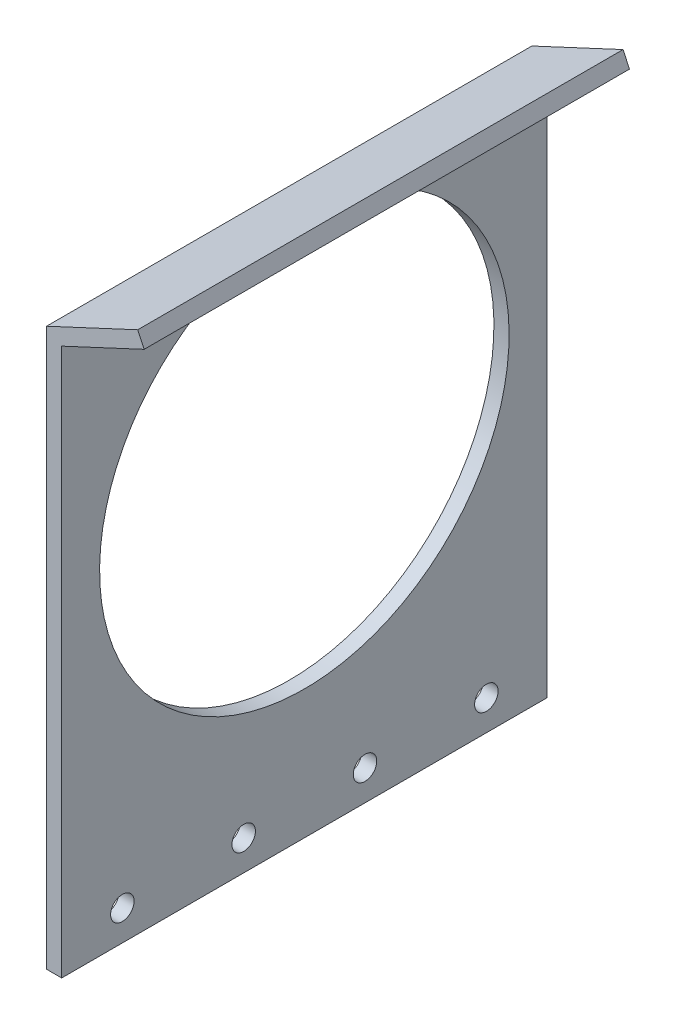
ISO-10303-21;
HEADER;
FILE_DESCRIPTION(('STEP AP214'),'2;1');
FILE_NAME('part.step','',(''),(''),'','','');
FILE_SCHEMA(('AUTOMOTIVE_DESIGN { 1 0 10303 214 1 1 1 1 }'));
ENDSEC;
DATA;
#1=APPLICATION_CONTEXT('core data for automotive mechanical design processes');
#2=APPLICATION_PROTOCOL_DEFINITION('international standard','automotive_design',2000,#1);
#3=PRODUCT_CONTEXT('',#1,'mechanical');
#4=PRODUCT('Part','Part','',(#3));
#5=PRODUCT_RELATED_PRODUCT_CATEGORY('part','',(#4));
#6=PRODUCT_DEFINITION_FORMATION('','',#4);
#7=PRODUCT_DEFINITION_CONTEXT('part definition',#1,'design');
#8=PRODUCT_DEFINITION('design','',#6,#7);
#9=PRODUCT_DEFINITION_SHAPE('','',#8);
#10=(LENGTH_UNIT() NAMED_UNIT(*) SI_UNIT(.MILLI.,.METRE.));
#11=(NAMED_UNIT(*) PLANE_ANGLE_UNIT() SI_UNIT($,.RADIAN.));
#12=(NAMED_UNIT(*) SI_UNIT($,.STERADIAN.) SOLID_ANGLE_UNIT());
#13=UNCERTAINTY_MEASURE_WITH_UNIT(LENGTH_MEASURE(1.E-05),#10,'distance_accuracy_value','');
#14=(GEOMETRIC_REPRESENTATION_CONTEXT(3) GLOBAL_UNCERTAINTY_ASSIGNED_CONTEXT((#13)) GLOBAL_UNIT_ASSIGNED_CONTEXT((#10,
#11,#12)) REPRESENTATION_CONTEXT('',''));
#15=CARTESIAN_POINT('',(0.,0.,0.));
#16=DIRECTION('',(0.,0.,1.));
#17=DIRECTION('',(1.,0.,0.));
#18=AXIS2_PLACEMENT_3D('',#15,#16,#17);
#19=CARTESIAN_POINT('',(3.175,0.,101.6));
#20=DIRECTION('',(0.,-1.,0.));
#21=DIRECTION('',(0.,0.,-1.));
#22=AXIS2_PLACEMENT_3D('',#19,#20,#21);
#23=PLANE('',#22);
#24=DIRECTION('',(-1.,0.,0.));
#25=VECTOR('',#24,1.);
#26=CARTESIAN_POINT('',(3.175,0.,0.));
#27=LINE('',#26,#25);
#28=CARTESIAN_POINT('',(3.175,0.,0.));
#29=VERTEX_POINT('',#28);
#30=CARTESIAN_POINT('',(0.,0.,0.));
#31=VERTEX_POINT('',#30);
#32=EDGE_CURVE('E118',#29,#31,#27,.T.);
#33=ORIENTED_EDGE('',*,*,#32,.F.);
#34=DIRECTION('',(0.,0.,-1.));
#35=VECTOR('',#34,1.);
#36=CARTESIAN_POINT('',(3.175,0.,101.6));
#37=LINE('',#36,#35);
#38=CARTESIAN_POINT('',(3.175,0.,101.6));
#39=VERTEX_POINT('',#38);
#40=EDGE_CURVE('E11',#39,#29,#37,.T.);
#41=ORIENTED_EDGE('',*,*,#40,.F.);
#42=DIRECTION('',(-1.,0.,0.));
#43=VECTOR('',#42,1.);
#44=CARTESIAN_POINT('',(3.175,0.,101.6));
#45=LINE('',#44,#43);
#46=CARTESIAN_POINT('',(0.,0.,101.6));
#47=VERTEX_POINT('',#46);
#48=EDGE_CURVE('E133',#39,#47,#45,.T.);
#49=ORIENTED_EDGE('',*,*,#48,.T.);
#50=DIRECTION('',(0.,0.,-1.));
#51=VECTOR('',#50,1.);
#52=CARTESIAN_POINT('',(0.,0.,101.6));
#53=LINE('',#52,#51);
#54=EDGE_CURVE('E82',#47,#31,#53,.T.);
#55=ORIENTED_EDGE('',*,*,#54,.T.);
#56=EDGE_LOOP('',(#33,#41,#49,#55));
#57=FACE_BOUND('',#56,.T.);
#58=ADVANCED_FACE('F32',(#57),#23,.T.);
#59=CARTESIAN_POINT('',(3.17499999999999,114.554,101.6));
#60=DIRECTION('',(1.,0.,0.));
#61=DIRECTION('',(0.,1.,0.));
#62=AXIS2_PLACEMENT_3D('',#59,#60,#61);
#63=PLANE('',#62);
#64=CARTESIAN_POINT('',(3.17499999999999,69.85,50.8));
#65=DIRECTION('',(1.,0.,0.));
#66=DIRECTION('',(0.,1.,0.));
#67=AXIS2_PLACEMENT_3D('',#64,#65,#66);
#68=CIRCLE('',#67,42.8625);
#69=CARTESIAN_POINT('',(3.17499999999999,112.7125,50.8));
#70=VERTEX_POINT('',#69);
#71=EDGE_CURVE('E202',#70,#70,#68,.T.);
#72=ORIENTED_EDGE('',*,*,#71,.F.);
#73=EDGE_LOOP('',(#72));
#74=FACE_BOUND('',#73,.T.);
#75=CARTESIAN_POINT('',(3.175,6.34999999999999,88.9));
#76=DIRECTION('',(1.,0.,0.));
#77=DIRECTION('',(0.,0.,-1.));
#78=AXIS2_PLACEMENT_3D('',#75,#76,#77);
#79=CIRCLE('',#78,2.45744999999999);
#80=CARTESIAN_POINT('',(3.175,6.34999999999999,86.44255));
#81=VERTEX_POINT('',#80);
#82=EDGE_CURVE('E199',#81,#81,#79,.T.);
#83=ORIENTED_EDGE('',*,*,#82,.F.);
#84=EDGE_LOOP('',(#83));
#85=FACE_BOUND('',#84,.T.);
#86=CARTESIAN_POINT('',(3.175,6.35,63.5));
#87=DIRECTION('',(1.,0.,0.));
#88=DIRECTION('',(0.,0.,-1.));
#89=AXIS2_PLACEMENT_3D('',#86,#87,#88);
#90=CIRCLE('',#89,2.45744999999999);
#91=CARTESIAN_POINT('',(3.175,6.35,61.04255));
#92=VERTEX_POINT('',#91);
#93=EDGE_CURVE('E195',#92,#92,#90,.T.);
#94=ORIENTED_EDGE('',*,*,#93,.F.);
#95=EDGE_LOOP('',(#94));
#96=FACE_BOUND('',#95,.T.);
#97=CARTESIAN_POINT('',(3.175,6.35,38.1));
#98=DIRECTION('',(1.,0.,0.));
#99=DIRECTION('',(0.,0.,-1.));
#100=AXIS2_PLACEMENT_3D('',#97,#98,#99);
#101=CIRCLE('',#100,2.45744999999999);
#102=CARTESIAN_POINT('',(3.175,6.35,35.64255));
#103=VERTEX_POINT('',#102);
#104=EDGE_CURVE('E191',#103,#103,#101,.T.);
#105=ORIENTED_EDGE('',*,*,#104,.F.);
#106=EDGE_LOOP('',(#105));
#107=FACE_BOUND('',#106,.T.);
#108=CARTESIAN_POINT('',(3.175,6.35,12.7));
#109=DIRECTION('',(1.,0.,0.));
#110=DIRECTION('',(0.,0.,-1.));
#111=AXIS2_PLACEMENT_3D('',#108,#109,#110);
#112=CIRCLE('',#111,2.45744999999999);
#113=CARTESIAN_POINT('',(3.175,6.35,10.24255));
#114=VERTEX_POINT('',#113);
#115=EDGE_CURVE('E184',#114,#114,#112,.T.);
#116=ORIENTED_EDGE('',*,*,#115,.F.);
#117=EDGE_LOOP('',(#116));
#118=FACE_BOUND('',#117,.T.);
#119=DIRECTION('',(0.,-1.,0.));
#120=VECTOR('',#119,1.);
#121=CARTESIAN_POINT('',(3.17499999999999,114.554,0.));
#122=LINE('',#121,#120);
#123=CARTESIAN_POINT('',(3.17499999999999,114.554,0.));
#124=VERTEX_POINT('',#123);
#125=EDGE_CURVE('E131',#124,#29,#122,.T.);
#126=ORIENTED_EDGE('',*,*,#125,.F.);
#127=DIRECTION('',(0.,0.,-1.));
#128=VECTOR('',#127,1.);
#129=CARTESIAN_POINT('',(3.17499999999999,114.554,101.6));
#130=LINE('',#129,#128);
#131=CARTESIAN_POINT('',(3.17499999999999,114.554,101.6));
#132=VERTEX_POINT('',#131);
#133=EDGE_CURVE('E41',#132,#124,#130,.T.);
#134=ORIENTED_EDGE('',*,*,#133,.F.);
#135=DIRECTION('',(0.,-1.,0.));
#136=VECTOR('',#135,1.);
#137=CARTESIAN_POINT('',(3.17499999999999,114.554,101.6));
#138=LINE('',#137,#136);
#139=EDGE_CURVE('E108',#132,#39,#138,.T.);
#140=ORIENTED_EDGE('',*,*,#139,.T.);
#141=ORIENTED_EDGE('',*,*,#40,.T.);
#142=EDGE_LOOP('',(#126,#134,#140,#141));
#143=FACE_BOUND('',#142,.T.);
#144=ADVANCED_FACE('F142',(#74,#85,#96,#107,#118,#143),#63,.T.);
#145=CARTESIAN_POINT('',(20.4401633430482,122.60487788616,101.6));
#146=DIRECTION('',(0.422618261740696,-0.906307787036651,0.));
#147=DIRECTION('',(0.906307787036651,0.422618261740697,0.));
#148=AXIS2_PLACEMENT_3D('',#145,#146,#147);
#149=PLANE('',#148);
#150=DIRECTION('',(-0.906307787036651,-0.422618261740697,0.));
#151=VECTOR('',#150,1.);
#152=CARTESIAN_POINT('',(20.4401633430482,122.60487788616,0.));
#153=LINE('',#152,#151);
#154=CARTESIAN_POINT('',(20.4401633430482,122.60487788616,0.));
#155=VERTEX_POINT('',#154);
#156=EDGE_CURVE('E95',#155,#124,#153,.T.);
#157=ORIENTED_EDGE('',*,*,#156,.F.);
#158=DIRECTION('',(0.,0.,-1.));
#159=VECTOR('',#158,1.);
#160=CARTESIAN_POINT('',(20.4401633430482,122.60487788616,101.6));
#161=LINE('',#160,#159);
#162=CARTESIAN_POINT('',(20.4401633430482,122.60487788616,101.6));
#163=VERTEX_POINT('',#162);
#164=EDGE_CURVE('E90',#163,#155,#161,.T.);
#165=ORIENTED_EDGE('',*,*,#164,.F.);
#166=DIRECTION('',(-0.906307787036651,-0.422618261740697,0.));
#167=VECTOR('',#166,1.);
#168=CARTESIAN_POINT('',(20.4401633430482,122.60487788616,101.6));
#169=LINE('',#168,#167);
#170=EDGE_CURVE('E93',#163,#132,#169,.T.);
#171=ORIENTED_EDGE('',*,*,#170,.T.);
#172=ORIENTED_EDGE('',*,*,#133,.T.);
#173=EDGE_LOOP('',(#157,#165,#171,#172));
#174=FACE_BOUND('',#173,.T.);
#175=ADVANCED_FACE('F92',(#174),#149,.T.);
#176=CARTESIAN_POINT('',(19.0983503620215,125.482405110002,101.6));
#177=DIRECTION('',(0.906307787036651,0.422618261740697,0.));
#178=DIRECTION('',(-0.422618261740697,0.906307787036651,0.));
#179=AXIS2_PLACEMENT_3D('',#176,#177,#178);
#180=PLANE('',#179);
#181=DIRECTION('',(0.422618261740697,-0.906307787036651,0.));
#182=VECTOR('',#181,1.);
#183=CARTESIAN_POINT('',(19.0983503620215,125.482405110002,0.));
#184=LINE('',#183,#182);
#185=CARTESIAN_POINT('',(19.0983503620215,125.482405110002,0.));
#186=VERTEX_POINT('',#185);
#187=EDGE_CURVE('E128',#186,#155,#184,.T.);
#188=ORIENTED_EDGE('',*,*,#187,.F.);
#189=DIRECTION('',(0.,0.,-1.));
#190=VECTOR('',#189,1.);
#191=CARTESIAN_POINT('',(19.0983503620215,125.482405110002,101.6));
#192=LINE('',#191,#190);
#193=CARTESIAN_POINT('',(19.0983503620215,125.482405110002,101.6));
#194=VERTEX_POINT('',#193);
#195=EDGE_CURVE('E100',#194,#186,#192,.T.);
#196=ORIENTED_EDGE('',*,*,#195,.F.);
#197=DIRECTION('',(0.422618261740697,-0.906307787036651,0.));
#198=VECTOR('',#197,1.);
#199=CARTESIAN_POINT('',(19.0983503620215,125.482405110002,101.6));
#200=LINE('',#199,#198);
#201=EDGE_CURVE('E106',#194,#163,#200,.T.);
#202=ORIENTED_EDGE('',*,*,#201,.T.);
#203=ORIENTED_EDGE('',*,*,#164,.T.);
#204=EDGE_LOOP('',(#188,#196,#202,#203));
#205=FACE_BOUND('',#204,.T.);
#206=ADVANCED_FACE('F110',(#205),#180,.T.);
#207=CARTESIAN_POINT('',(0.,116.576698078064,101.6));
#208=DIRECTION('',(-0.422618261740696,0.906307787036651,0.));
#209=DIRECTION('',(-0.906307787036651,-0.422618261740696,0.));
#210=AXIS2_PLACEMENT_3D('',#207,#208,#209);
#211=PLANE('',#210);
#212=DIRECTION('',(0.906307787036651,0.422618261740696,0.));
#213=VECTOR('',#212,1.);
#214=CARTESIAN_POINT('',(0.,116.576698078064,0.));
#215=LINE('',#214,#213);
#216=CARTESIAN_POINT('',(0.,116.576698078064,0.));
#217=VERTEX_POINT('',#216);
#218=EDGE_CURVE('E125',#217,#186,#215,.T.);
#219=ORIENTED_EDGE('',*,*,#218,.F.);
#220=DIRECTION('',(0.,0.,-1.));
#221=VECTOR('',#220,1.);
#222=CARTESIAN_POINT('',(0.,116.576698078064,101.6));
#223=LINE('',#222,#221);
#224=CARTESIAN_POINT('',(0.,116.576698078064,101.6));
#225=VERTEX_POINT('',#224);
#226=EDGE_CURVE('E137',#225,#217,#223,.T.);
#227=ORIENTED_EDGE('',*,*,#226,.F.);
#228=DIRECTION('',(0.906307787036651,0.422618261740696,0.));
#229=VECTOR('',#228,1.);
#230=CARTESIAN_POINT('',(0.,116.576698078064,101.6));
#231=LINE('',#230,#229);
#232=EDGE_CURVE('E111',#225,#194,#231,.T.);
#233=ORIENTED_EDGE('',*,*,#232,.T.);
#234=ORIENTED_EDGE('',*,*,#195,.T.);
#235=EDGE_LOOP('',(#219,#227,#233,#234));
#236=FACE_BOUND('',#235,.T.);
#237=ADVANCED_FACE('F158',(#236),#211,.T.);
#238=CARTESIAN_POINT('',(0.,0.,101.6));
#239=DIRECTION('',(-1.,0.,0.));
#240=DIRECTION('',(0.,0.,1.));
#241=AXIS2_PLACEMENT_3D('',#238,#239,#240);
#242=PLANE('',#241);
#243=CARTESIAN_POINT('',(0.,69.85,50.8));
#244=DIRECTION('',(-1.,0.,0.));
#245=DIRECTION('',(0.,0.,1.));
#246=AXIS2_PLACEMENT_3D('',#243,#244,#245);
#247=CIRCLE('',#246,42.8625);
#248=CARTESIAN_POINT('',(0.,69.85,93.6625));
#249=VERTEX_POINT('',#248);
#250=EDGE_CURVE('E35',#249,#249,#247,.T.);
#251=ORIENTED_EDGE('',*,*,#250,.F.);
#252=EDGE_LOOP('',(#251));
#253=FACE_BOUND('',#252,.T.);
#254=CARTESIAN_POINT('',(0.,6.34999999999999,88.9));
#255=DIRECTION('',(1.,0.,0.));
#256=DIRECTION('',(0.,0.,-1.));
#257=AXIS2_PLACEMENT_3D('',#254,#255,#256);
#258=CIRCLE('',#257,2.45745);
#259=CARTESIAN_POINT('',(0.,6.34999999999999,86.44255));
#260=VERTEX_POINT('',#259);
#261=EDGE_CURVE('E172',#260,#260,#258,.T.);
#262=ORIENTED_EDGE('',*,*,#261,.T.);
#263=EDGE_LOOP('',(#262));
#264=FACE_BOUND('',#263,.T.);
#265=CARTESIAN_POINT('',(0.,6.35,63.5));
#266=DIRECTION('',(1.,0.,0.));
#267=DIRECTION('',(0.,0.,-1.));
#268=AXIS2_PLACEMENT_3D('',#265,#266,#267);
#269=CIRCLE('',#268,2.45745);
#270=CARTESIAN_POINT('',(0.,6.35,61.04255));
#271=VERTEX_POINT('',#270);
#272=EDGE_CURVE('E176',#271,#271,#269,.T.);
#273=ORIENTED_EDGE('',*,*,#272,.T.);
#274=EDGE_LOOP('',(#273));
#275=FACE_BOUND('',#274,.T.);
#276=CARTESIAN_POINT('',(0.,6.35,38.1));
#277=DIRECTION('',(1.,0.,0.));
#278=DIRECTION('',(0.,0.,-1.));
#279=AXIS2_PLACEMENT_3D('',#276,#277,#278);
#280=CIRCLE('',#279,2.45745);
#281=CARTESIAN_POINT('',(0.,6.35,35.64255));
#282=VERTEX_POINT('',#281);
#283=EDGE_CURVE('E180',#282,#282,#280,.T.);
#284=ORIENTED_EDGE('',*,*,#283,.T.);
#285=EDGE_LOOP('',(#284));
#286=FACE_BOUND('',#285,.T.);
#287=CARTESIAN_POINT('',(0.,6.35,12.7));
#288=DIRECTION('',(1.,0.,0.));
#289=DIRECTION('',(0.,0.,-1.));
#290=AXIS2_PLACEMENT_3D('',#287,#288,#289);
#291=CIRCLE('',#290,2.45745);
#292=CARTESIAN_POINT('',(0.,6.35,10.24255));
#293=VERTEX_POINT('',#292);
#294=EDGE_CURVE('E122',#293,#293,#291,.T.);
#295=ORIENTED_EDGE('',*,*,#294,.T.);
#296=EDGE_LOOP('',(#295));
#297=FACE_BOUND('',#296,.T.);
#298=DIRECTION('',(0.,1.,0.));
#299=VECTOR('',#298,1.);
#300=CARTESIAN_POINT('',(0.,0.,0.));
#301=LINE('',#300,#299);
#302=EDGE_CURVE('E121',#31,#217,#301,.T.);
#303=ORIENTED_EDGE('',*,*,#302,.F.);
#304=ORIENTED_EDGE('',*,*,#54,.F.);
#305=DIRECTION('',(0.,1.,0.));
#306=VECTOR('',#305,1.);
#307=CARTESIAN_POINT('',(0.,0.,101.6));
#308=LINE('',#307,#306);
#309=EDGE_CURVE('E113',#47,#225,#308,.T.);
#310=ORIENTED_EDGE('',*,*,#309,.T.);
#311=ORIENTED_EDGE('',*,*,#226,.T.);
#312=EDGE_LOOP('',(#303,#304,#310,#311));
#313=FACE_BOUND('',#312,.T.);
#314=ADVANCED_FACE('F138',(#253,#264,#275,#286,#297,#313),#242,.T.);
#315=CARTESIAN_POINT('',(0.,0.,101.6));
#316=DIRECTION('',(0.,0.,-1.));
#317=DIRECTION('',(-1.,0.,0.));
#318=AXIS2_PLACEMENT_3D('',#315,#316,#317);
#319=PLANE('',#318);
#320=ORIENTED_EDGE('',*,*,#48,.F.);
#321=ORIENTED_EDGE('',*,*,#139,.F.);
#322=ORIENTED_EDGE('',*,*,#170,.F.);
#323=ORIENTED_EDGE('',*,*,#201,.F.);
#324=ORIENTED_EDGE('',*,*,#232,.F.);
#325=ORIENTED_EDGE('',*,*,#309,.F.);
#326=EDGE_LOOP('',(#320,#321,#322,#323,#324,#325));
#327=FACE_BOUND('',#326,.T.);
#328=ADVANCED_FACE('F104',(#327),#319,.F.);
#329=CARTESIAN_POINT('',(0.,0.,0.));
#330=DIRECTION('',(0.,0.,-1.));
#331=DIRECTION('',(-1.,0.,0.));
#332=AXIS2_PLACEMENT_3D('',#329,#330,#331);
#333=PLANE('',#332);
#334=ORIENTED_EDGE('',*,*,#32,.T.);
#335=ORIENTED_EDGE('',*,*,#302,.T.);
#336=ORIENTED_EDGE('',*,*,#218,.T.);
#337=ORIENTED_EDGE('',*,*,#187,.T.);
#338=ORIENTED_EDGE('',*,*,#156,.T.);
#339=ORIENTED_EDGE('',*,*,#125,.T.);
#340=EDGE_LOOP('',(#334,#335,#336,#337,#338,#339));
#341=FACE_BOUND('',#340,.T.);
#342=ADVANCED_FACE('F141',(#341),#333,.T.);
#343=CARTESIAN_POINT('',(3.175,6.35,12.7));
#344=DIRECTION('',(1.,0.,0.));
#345=DIRECTION('',(0.,0.,-1.));
#346=AXIS2_PLACEMENT_3D('',#343,#344,#345);
#347=CYLINDRICAL_SURFACE('',#346,2.45744999999999);
#348=ORIENTED_EDGE('',*,*,#294,.F.);
#349=EDGE_LOOP('',(#348));
#350=FACE_BOUND('',#349,.T.);
#351=ORIENTED_EDGE('',*,*,#115,.T.);
#352=EDGE_LOOP('',(#351));
#353=FACE_BOUND('',#352,.T.);
#354=ADVANCED_FACE('F223',(#350,#353),#347,.F.);
#355=CARTESIAN_POINT('',(3.175,6.35,38.1));
#356=DIRECTION('',(1.,0.,0.));
#357=DIRECTION('',(0.,0.,-1.));
#358=AXIS2_PLACEMENT_3D('',#355,#356,#357);
#359=CYLINDRICAL_SURFACE('',#358,2.45744999999999);
#360=ORIENTED_EDGE('',*,*,#283,.F.);
#361=EDGE_LOOP('',(#360));
#362=FACE_BOUND('',#361,.T.);
#363=ORIENTED_EDGE('',*,*,#104,.T.);
#364=EDGE_LOOP('',(#363));
#365=FACE_BOUND('',#364,.T.);
#366=ADVANCED_FACE('F219',(#362,#365),#359,.F.);
#367=CARTESIAN_POINT('',(3.175,6.35,63.5));
#368=DIRECTION('',(1.,0.,0.));
#369=DIRECTION('',(0.,0.,-1.));
#370=AXIS2_PLACEMENT_3D('',#367,#368,#369);
#371=CYLINDRICAL_SURFACE('',#370,2.45744999999999);
#372=ORIENTED_EDGE('',*,*,#272,.F.);
#373=EDGE_LOOP('',(#372));
#374=FACE_BOUND('',#373,.T.);
#375=ORIENTED_EDGE('',*,*,#93,.T.);
#376=EDGE_LOOP('',(#375));
#377=FACE_BOUND('',#376,.T.);
#378=ADVANCED_FACE('F213',(#374,#377),#371,.F.);
#379=CARTESIAN_POINT('',(3.175,6.34999999999999,88.9));
#380=DIRECTION('',(1.,0.,0.));
#381=DIRECTION('',(0.,0.,-1.));
#382=AXIS2_PLACEMENT_3D('',#379,#380,#381);
#383=CYLINDRICAL_SURFACE('',#382,2.45744999999999);
#384=ORIENTED_EDGE('',*,*,#261,.F.);
#385=EDGE_LOOP('',(#384));
#386=FACE_BOUND('',#385,.T.);
#387=ORIENTED_EDGE('',*,*,#82,.T.);
#388=EDGE_LOOP('',(#387));
#389=FACE_BOUND('',#388,.T.);
#390=ADVANCED_FACE('F208',(#386,#389),#383,.F.);
#391=CARTESIAN_POINT('',(-123.825,69.85,50.8));
#392=DIRECTION('',(1.,0.,0.));
#393=DIRECTION('',(0.,1.,0.));
#394=AXIS2_PLACEMENT_3D('',#391,#392,#393);
#395=CYLINDRICAL_SURFACE('',#394,42.8625);
#396=ORIENTED_EDGE('',*,*,#250,.T.);
#397=EDGE_LOOP('',(#396));
#398=FACE_BOUND('',#397,.T.);
#399=ORIENTED_EDGE('',*,*,#71,.T.);
#400=EDGE_LOOP('',(#399));
#401=FACE_BOUND('',#400,.T.);
#402=ADVANCED_FACE('F206',(#398,#401),#395,.F.);
#403=CLOSED_SHELL('',(#58,#144,#175,#206,#237,#314,#328,#342,#354,#366,#378,#390,#402));
#404=MANIFOLD_SOLID_BREP('B2',#403);
#405=ADVANCED_BREP_SHAPE_REPRESENTATION('',(#18,#404),#14);
#406=SHAPE_DEFINITION_REPRESENTATION(#9,#405);
ENDSEC;
END-ISO-10303-21;
